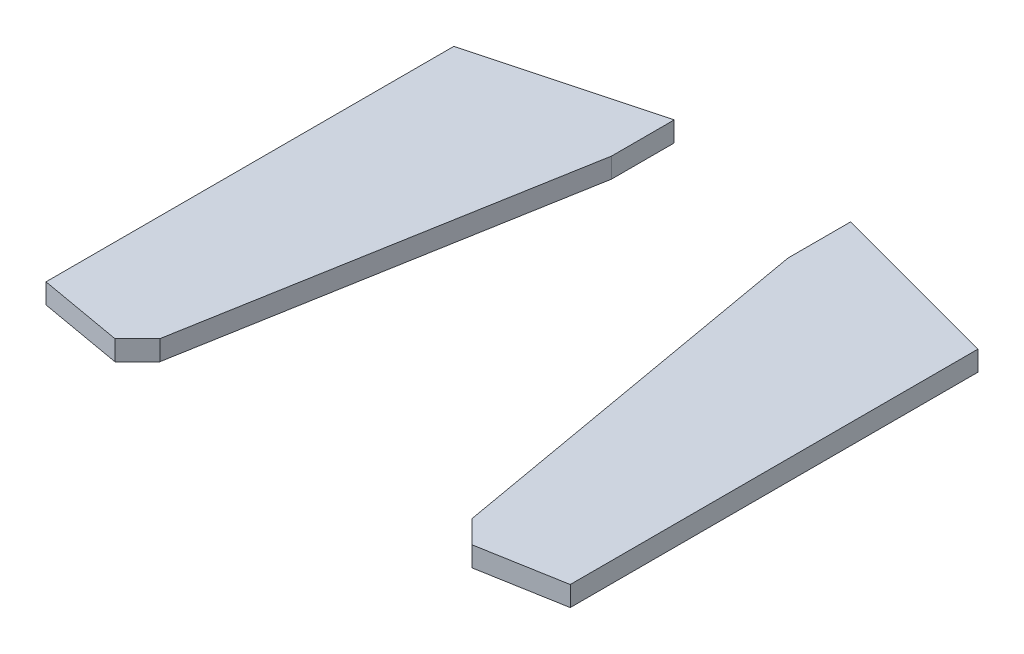
ISO-10303-21;
HEADER;
FILE_DESCRIPTION(('STEP AP214'),'2;1');
FILE_NAME('part.step','',(''),(''),'','','');
FILE_SCHEMA(('AUTOMOTIVE_DESIGN { 1 0 10303 214 1 1 1 1 }'));
ENDSEC;
DATA;
#1=APPLICATION_CONTEXT('core data for automotive mechanical design processes');
#2=APPLICATION_PROTOCOL_DEFINITION('international standard','automotive_design',2000,#1);
#3=PRODUCT_CONTEXT('',#1,'mechanical');
#4=PRODUCT('Part','Part','',(#3));
#5=PRODUCT_RELATED_PRODUCT_CATEGORY('part','',(#4));
#6=PRODUCT_DEFINITION_FORMATION('','',#4);
#7=PRODUCT_DEFINITION_CONTEXT('part definition',#1,'design');
#8=PRODUCT_DEFINITION('design','',#6,#7);
#9=PRODUCT_DEFINITION_SHAPE('','',#8);
#10=(LENGTH_UNIT() NAMED_UNIT(*) SI_UNIT(.MILLI.,.METRE.));
#11=(NAMED_UNIT(*) PLANE_ANGLE_UNIT() SI_UNIT($,.RADIAN.));
#12=(NAMED_UNIT(*) SI_UNIT($,.STERADIAN.) SOLID_ANGLE_UNIT());
#13=UNCERTAINTY_MEASURE_WITH_UNIT(LENGTH_MEASURE(1.E-05),#10,'distance_accuracy_value','');
#14=(GEOMETRIC_REPRESENTATION_CONTEXT(3) GLOBAL_UNCERTAINTY_ASSIGNED_CONTEXT((#13)) GLOBAL_UNIT_ASSIGNED_CONTEXT((#10,
#11,#12)) REPRESENTATION_CONTEXT('',''));
#15=CARTESIAN_POINT('',(0.,0.,0.));
#16=DIRECTION('',(0.,0.,1.));
#17=DIRECTION('',(1.,0.,0.));
#18=AXIS2_PLACEMENT_3D('',#15,#16,#17);
#19=CARTESIAN_POINT('',(982.928076994621,75.,748.468756702512));
#20=DIRECTION('',(-1.,0.,0.));
#21=DIRECTION('',(0.,0.,1.));
#22=AXIS2_PLACEMENT_3D('',#19,#20,#21);
#23=PLANE('',#22);
#24=DIRECTION('',(0.,0.,-1.));
#25=VECTOR('',#24,1.);
#26=CARTESIAN_POINT('',(982.928076994621,0.,748.468756702512));
#27=LINE('',#26,#25);
#28=CARTESIAN_POINT('',(982.928076994621,0.,748.468756702512));
#29=VERTEX_POINT('',#28);
#30=CARTESIAN_POINT('',(982.928076994621,0.,-780.737776154885));
#31=VERTEX_POINT('',#30);
#32=EDGE_CURVE('E12',#29,#31,#27,.T.);
#33=ORIENTED_EDGE('',*,*,#32,.T.);
#34=DIRECTION('',(0.,-1.,0.));
#35=VECTOR('',#34,1.);
#36=CARTESIAN_POINT('',(982.928076994621,75.,-780.737776154885));
#37=LINE('',#36,#35);
#38=CARTESIAN_POINT('',(982.928076994621,75.,-780.737776154885));
#39=VERTEX_POINT('',#38);
#40=EDGE_CURVE('E168',#39,#31,#37,.T.);
#41=ORIENTED_EDGE('',*,*,#40,.F.);
#42=DIRECTION('',(0.,0.,-1.));
#43=VECTOR('',#42,1.);
#44=CARTESIAN_POINT('',(982.928076994621,75.,748.468756702512));
#45=LINE('',#44,#43);
#46=CARTESIAN_POINT('',(982.928076994621,75.,748.468756702512));
#47=VERTEX_POINT('',#46);
#48=EDGE_CURVE('E53',#47,#39,#45,.T.);
#49=ORIENTED_EDGE('',*,*,#48,.F.);
#50=DIRECTION('',(0.,-1.,0.));
#51=VECTOR('',#50,1.);
#52=CARTESIAN_POINT('',(982.928076994621,75.,748.468756702512));
#53=LINE('',#52,#51);
#54=EDGE_CURVE('E144',#47,#29,#53,.T.);
#55=ORIENTED_EDGE('',*,*,#54,.T.);
#56=EDGE_LOOP('',(#33,#41,#49,#55));
#57=FACE_BOUND('',#56,.T.);
#58=ADVANCED_FACE('F49',(#57),#23,.F.);
#59=CARTESIAN_POINT('',(982.928076994621,75.,-780.737776154885));
#60=DIRECTION('',(-0.258819045102514,0.,0.96592582628907));
#61=DIRECTION('',(0.96592582628907,0.,0.258819045102514));
#62=AXIS2_PLACEMENT_3D('',#59,#60,#61);
#63=PLANE('',#62);
#64=DIRECTION('',(-0.96592582628907,0.,-0.258819045102514));
#65=VECTOR('',#64,1.);
#66=CARTESIAN_POINT('',(982.928076994621,0.,-780.737776154885));
#67=LINE('',#66,#65);
#68=CARTESIAN_POINT('',(330.905406559867,0.,-955.446724144657));
#69=VERTEX_POINT('',#68);
#70=EDGE_CURVE('E60',#31,#69,#67,.T.);
#71=ORIENTED_EDGE('',*,*,#70,.T.);
#72=DIRECTION('',(0.,-1.,0.));
#73=VECTOR('',#72,1.);
#74=CARTESIAN_POINT('',(330.905406559867,75.,-955.446724144657));
#75=LINE('',#74,#73);
#76=CARTESIAN_POINT('',(330.905406559867,75.,-955.446724144657));
#77=VERTEX_POINT('',#76);
#78=EDGE_CURVE('E125',#77,#69,#75,.T.);
#79=ORIENTED_EDGE('',*,*,#78,.F.);
#80=DIRECTION('',(-0.96592582628907,0.,-0.258819045102514));
#81=VECTOR('',#80,1.);
#82=CARTESIAN_POINT('',(982.928076994621,75.,-780.737776154885));
#83=LINE('',#82,#81);
#84=EDGE_CURVE('E92',#39,#77,#83,.T.);
#85=ORIENTED_EDGE('',*,*,#84,.F.);
#86=ORIENTED_EDGE('',*,*,#40,.T.);
#87=EDGE_LOOP('',(#71,#79,#85,#86));
#88=FACE_BOUND('',#87,.T.);
#89=ADVANCED_FACE('F170',(#88),#63,.F.);
#90=CARTESIAN_POINT('',(330.905406559867,75.,-720.543070196933));
#91=DIRECTION('',(-1.,0.,0.));
#92=DIRECTION('',(0.,0.,1.));
#93=AXIS2_PLACEMENT_3D('',#90,#91,#92);
#94=PLANE('',#93);
#95=DIRECTION('',(0.,0.,-1.));
#96=VECTOR('',#95,1.);
#97=CARTESIAN_POINT('',(330.905406559867,0.,-720.543070196933));
#98=LINE('',#97,#96);
#99=CARTESIAN_POINT('',(330.905406559867,0.,-720.543070196933));
#100=VERTEX_POINT('',#99);
#101=EDGE_CURVE('E129',#100,#69,#98,.T.);
#102=ORIENTED_EDGE('',*,*,#101,.F.);
#103=DIRECTION('',(0.,-1.,0.));
#104=VECTOR('',#103,1.);
#105=CARTESIAN_POINT('',(330.905406559867,75.,-720.543070196933));
#106=LINE('',#105,#104);
#107=CARTESIAN_POINT('',(330.905406559867,75.,-720.543070196933));
#108=VERTEX_POINT('',#107);
#109=EDGE_CURVE('E113',#108,#100,#106,.T.);
#110=ORIENTED_EDGE('',*,*,#109,.F.);
#111=DIRECTION('',(0.,0.,-1.));
#112=VECTOR('',#111,1.);
#113=CARTESIAN_POINT('',(330.905406559867,75.,-720.543070196933));
#114=LINE('',#113,#112);
#115=EDGE_CURVE('E149',#108,#77,#114,.T.);
#116=ORIENTED_EDGE('',*,*,#115,.T.);
#117=ORIENTED_EDGE('',*,*,#78,.T.);
#118=EDGE_LOOP('',(#102,#110,#116,#117));
#119=FACE_BOUND('',#118,.T.);
#120=ADVANCED_FACE('F133',(#119),#94,.T.);
#121=CARTESIAN_POINT('',(330.905406559867,75.,-720.543070196933));
#122=DIRECTION('',(0.984807753012208,0.,-0.173648177666927));
#123=DIRECTION('',(-0.173648177666927,0.,-0.984807753012209));
#124=AXIS2_PLACEMENT_3D('',#121,#122,#123);
#125=PLANE('',#124);
#126=DIRECTION('',(0.173648177666927,0.,0.984807753012208));
#127=VECTOR('',#126,1.);
#128=CARTESIAN_POINT('',(330.905406559867,0.,-720.543070196933));
#129=LINE('',#128,#127);
#130=CARTESIAN_POINT('',(584.865866397748,0.,719.738268583422));
#131=VERTEX_POINT('',#130);
#132=EDGE_CURVE('E117',#100,#131,#129,.T.);
#133=ORIENTED_EDGE('',*,*,#132,.T.);
#134=DIRECTION('',(0.,-1.,0.));
#135=VECTOR('',#134,1.);
#136=CARTESIAN_POINT('',(584.865866397748,75.,719.738268583422));
#137=LINE('',#136,#135);
#138=CARTESIAN_POINT('',(584.865866397748,75.,719.738268583422));
#139=VERTEX_POINT('',#138);
#140=EDGE_CURVE('E124',#139,#131,#137,.T.);
#141=ORIENTED_EDGE('',*,*,#140,.F.);
#142=DIRECTION('',(0.173648177666927,0.,0.984807753012208));
#143=VECTOR('',#142,1.);
#144=CARTESIAN_POINT('',(330.905406559867,75.,-720.543070196933));
#145=LINE('',#144,#143);
#146=EDGE_CURVE('E119',#108,#139,#145,.T.);
#147=ORIENTED_EDGE('',*,*,#146,.F.);
#148=ORIENTED_EDGE('',*,*,#109,.T.);
#149=EDGE_LOOP('',(#133,#141,#147,#148));
#150=FACE_BOUND('',#149,.T.);
#151=ADVANCED_FACE('F115',(#150),#125,.F.);
#152=CARTESIAN_POINT('',(584.865866397748,75.,719.738268583422));
#153=DIRECTION('',(0.707106781186539,0.,-0.707106781186556));
#154=DIRECTION('',(-0.707106781186556,0.,-0.707106781186539));
#155=AXIS2_PLACEMENT_3D('',#152,#153,#154);
#156=PLANE('',#155);
#157=DIRECTION('',(0.707106781186556,0.,0.707106781186539));
#158=VECTOR('',#157,1.);
#159=CARTESIAN_POINT('',(584.865866397748,0.,719.738268583422));
#160=LINE('',#159,#158);
#161=CARTESIAN_POINT('',(668.957787666271,0.,803.830189851942));
#162=VERTEX_POINT('',#161);
#163=EDGE_CURVE('E130',#131,#162,#160,.T.);
#164=ORIENTED_EDGE('',*,*,#163,.T.);
#165=DIRECTION('',(0.,-1.,0.));
#166=VECTOR('',#165,1.);
#167=CARTESIAN_POINT('',(668.957787666271,75.,803.830189851942));
#168=LINE('',#167,#166);
#169=CARTESIAN_POINT('',(668.957787666271,75.,803.830189851942));
#170=VERTEX_POINT('',#169);
#171=EDGE_CURVE('E161',#170,#162,#168,.T.);
#172=ORIENTED_EDGE('',*,*,#171,.F.);
#173=DIRECTION('',(0.707106781186556,0.,0.707106781186539));
#174=VECTOR('',#173,1.);
#175=CARTESIAN_POINT('',(584.865866397748,75.,719.738268583422));
#176=LINE('',#175,#174);
#177=EDGE_CURVE('E143',#139,#170,#176,.T.);
#178=ORIENTED_EDGE('',*,*,#177,.F.);
#179=ORIENTED_EDGE('',*,*,#140,.T.);
#180=EDGE_LOOP('',(#164,#172,#178,#179));
#181=FACE_BOUND('',#180,.T.);
#182=ADVANCED_FACE('F177',(#181),#156,.F.);
#183=CARTESIAN_POINT('',(668.957787666271,75.,803.830189851942));
#184=DIRECTION('',(-0.173648177666927,0.,-0.984807753012209));
#185=DIRECTION('',(-0.984807753012209,0.,0.173648177666927));
#186=AXIS2_PLACEMENT_3D('',#183,#184,#185);
#187=PLANE('',#186);
#188=DIRECTION('',(0.984807753012209,0.,-0.173648177666927));
#189=VECTOR('',#188,1.);
#190=CARTESIAN_POINT('',(668.957787666271,0.,803.830189851942));
#191=LINE('',#190,#189);
#192=EDGE_CURVE('E103',#162,#29,#191,.T.);
#193=ORIENTED_EDGE('',*,*,#192,.T.);
#194=ORIENTED_EDGE('',*,*,#54,.F.);
#195=DIRECTION('',(0.984807753012209,0.,-0.173648177666927));
#196=VECTOR('',#195,1.);
#197=CARTESIAN_POINT('',(668.957787666271,75.,803.830189851942));
#198=LINE('',#197,#196);
#199=EDGE_CURVE('E140',#170,#47,#198,.T.);
#200=ORIENTED_EDGE('',*,*,#199,.F.);
#201=ORIENTED_EDGE('',*,*,#171,.T.);
#202=EDGE_LOOP('',(#193,#194,#200,#201));
#203=FACE_BOUND('',#202,.T.);
#204=ADVANCED_FACE('F173',(#203),#187,.F.);
#205=CARTESIAN_POINT('',(0.,75.,0.));
#206=DIRECTION('',(0.,-1.,0.));
#207=DIRECTION('',(0.,0.,-1.));
#208=AXIS2_PLACEMENT_3D('',#205,#206,#207);
#209=PLANE('',#208);
#210=ORIENTED_EDGE('',*,*,#48,.T.);
#211=ORIENTED_EDGE('',*,*,#84,.T.);
#212=ORIENTED_EDGE('',*,*,#115,.F.);
#213=ORIENTED_EDGE('',*,*,#146,.T.);
#214=ORIENTED_EDGE('',*,*,#177,.T.);
#215=ORIENTED_EDGE('',*,*,#199,.T.);
#216=EDGE_LOOP('',(#210,#211,#212,#213,#214,#215));
#217=FACE_BOUND('',#216,.T.);
#218=ADVANCED_FACE('F51',(#217),#209,.F.);
#219=CARTESIAN_POINT('',(0.,0.,0.));
#220=DIRECTION('',(0.,-1.,0.));
#221=DIRECTION('',(0.,0.,-1.));
#222=AXIS2_PLACEMENT_3D('',#219,#220,#221);
#223=PLANE('',#222);
#224=ORIENTED_EDGE('',*,*,#32,.F.);
#225=ORIENTED_EDGE('',*,*,#192,.F.);
#226=ORIENTED_EDGE('',*,*,#163,.F.);
#227=ORIENTED_EDGE('',*,*,#132,.F.);
#228=ORIENTED_EDGE('',*,*,#101,.T.);
#229=ORIENTED_EDGE('',*,*,#70,.F.);
#230=EDGE_LOOP('',(#224,#225,#226,#227,#228,#229));
#231=FACE_BOUND('',#230,.T.);
#232=ADVANCED_FACE('F128',(#231),#223,.T.);
#233=CLOSED_SHELL('',(#58,#89,#120,#151,#182,#204,#218,#232));
#234=MANIFOLD_SOLID_BREP('B2',#233);
#235=CARTESIAN_POINT('',(-669.226054870774,75.,803.830189851942));
#236=DIRECTION('',(-0.173648177666927,0.,0.984807753012209));
#237=DIRECTION('',(0.984807753012209,0.,0.173648177666927));
#238=AXIS2_PLACEMENT_3D('',#235,#236,#237);
#239=PLANE('',#238);
#240=DIRECTION('',(-0.984807753012209,0.,-0.173648177666927));
#241=VECTOR('',#240,1.);
#242=CARTESIAN_POINT('',(-669.226054870774,0.,803.830189851942));
#243=LINE('',#242,#241);
#244=CARTESIAN_POINT('',(-669.226054870774,0.,803.830189851942));
#245=VERTEX_POINT('',#244);
#246=CARTESIAN_POINT('',(-983.196344199125,0.,748.468756702512));
#247=VERTEX_POINT('',#246);
#248=EDGE_CURVE('E326',#245,#247,#243,.T.);
#249=ORIENTED_EDGE('',*,*,#248,.F.);
#250=DIRECTION('',(0.,-1.,0.));
#251=VECTOR('',#250,1.);
#252=CARTESIAN_POINT('',(-669.226054870774,75.,803.830189851942));
#253=LINE('',#252,#251);
#254=CARTESIAN_POINT('',(-669.226054870774,75.,803.830189851942));
#255=VERTEX_POINT('',#254);
#256=EDGE_CURVE('E47',#255,#245,#253,.T.);
#257=ORIENTED_EDGE('',*,*,#256,.F.);
#258=DIRECTION('',(-0.984807753012209,0.,-0.173648177666927));
#259=VECTOR('',#258,1.);
#260=CARTESIAN_POINT('',(-669.226054870774,75.,803.830189851942));
#261=LINE('',#260,#259);
#262=CARTESIAN_POINT('',(-983.196344199125,75.,748.468756702512));
#263=VERTEX_POINT('',#262);
#264=EDGE_CURVE('E340',#255,#263,#261,.T.);
#265=ORIENTED_EDGE('',*,*,#264,.T.);
#266=DIRECTION('',(0.,-1.,0.));
#267=VECTOR('',#266,1.);
#268=CARTESIAN_POINT('',(-983.196344199125,75.,748.468756702512));
#269=LINE('',#268,#267);
#270=EDGE_CURVE('E246',#263,#247,#269,.T.);
#271=ORIENTED_EDGE('',*,*,#270,.T.);
#272=EDGE_LOOP('',(#249,#257,#265,#271));
#273=FACE_BOUND('',#272,.T.);
#274=ADVANCED_FACE('F243',(#273),#239,.T.);
#275=CARTESIAN_POINT('',(-585.134133602252,75.,719.738268583422));
#276=DIRECTION('',(0.707106781186539,0.,0.707106781186556));
#277=DIRECTION('',(0.707106781186556,0.,-0.707106781186539));
#278=AXIS2_PLACEMENT_3D('',#275,#276,#277);
#279=PLANE('',#278);
#280=DIRECTION('',(-0.707106781186556,0.,0.707106781186539));
#281=VECTOR('',#280,1.);
#282=CARTESIAN_POINT('',(-585.134133602252,0.,719.738268583422));
#283=LINE('',#282,#281);
#284=CARTESIAN_POINT('',(-585.134133602252,0.,719.738268583422));
#285=VERTEX_POINT('',#284);
#286=EDGE_CURVE('E338',#285,#245,#283,.T.);
#287=ORIENTED_EDGE('',*,*,#286,.F.);
#288=DIRECTION('',(0.,-1.,0.));
#289=VECTOR('',#288,1.);
#290=CARTESIAN_POINT('',(-585.134133602252,75.,719.738268583422));
#291=LINE('',#290,#289);
#292=CARTESIAN_POINT('',(-585.134133602252,75.,719.738268583422));
#293=VERTEX_POINT('',#292);
#294=EDGE_CURVE('E252',#293,#285,#291,.T.);
#295=ORIENTED_EDGE('',*,*,#294,.F.);
#296=DIRECTION('',(-0.707106781186556,0.,0.707106781186539));
#297=VECTOR('',#296,1.);
#298=CARTESIAN_POINT('',(-585.134133602252,75.,719.738268583422));
#299=LINE('',#298,#297);
#300=EDGE_CURVE('E321',#293,#255,#299,.T.);
#301=ORIENTED_EDGE('',*,*,#300,.T.);
#302=ORIENTED_EDGE('',*,*,#256,.T.);
#303=EDGE_LOOP('',(#287,#295,#301,#302));
#304=FACE_BOUND('',#303,.T.);
#305=ADVANCED_FACE('F348',(#304),#279,.T.);
#306=CARTESIAN_POINT('',(-331.17367376437,75.,-720.543070196932));
#307=DIRECTION('',(0.984807753012208,0.,0.173648177666928));
#308=DIRECTION('',(0.173648177666928,0.,-0.984807753012209));
#309=AXIS2_PLACEMENT_3D('',#306,#307,#308);
#310=PLANE('',#309);
#311=DIRECTION('',(-0.173648177666928,0.,0.984807753012208));
#312=VECTOR('',#311,1.);
#313=CARTESIAN_POINT('',(-331.17367376437,0.,-720.543070196932));
#314=LINE('',#313,#312);
#315=CARTESIAN_POINT('',(-331.17367376437,0.,-720.543070196932));
#316=VERTEX_POINT('',#315);
#317=EDGE_CURVE('E306',#316,#285,#314,.T.);
#318=ORIENTED_EDGE('',*,*,#317,.F.);
#319=DIRECTION('',(0.,-1.,0.));
#320=VECTOR('',#319,1.);
#321=CARTESIAN_POINT('',(-331.17367376437,75.,-720.543070196932));
#322=LINE('',#321,#320);
#323=CARTESIAN_POINT('',(-331.17367376437,75.,-720.543070196932));
#324=VERTEX_POINT('',#323);
#325=EDGE_CURVE('E300',#324,#316,#322,.T.);
#326=ORIENTED_EDGE('',*,*,#325,.F.);
#327=DIRECTION('',(-0.173648177666928,0.,0.984807753012208));
#328=VECTOR('',#327,1.);
#329=CARTESIAN_POINT('',(-331.17367376437,75.,-720.543070196932));
#330=LINE('',#329,#328);
#331=EDGE_CURVE('E304',#324,#293,#330,.T.);
#332=ORIENTED_EDGE('',*,*,#331,.T.);
#333=ORIENTED_EDGE('',*,*,#294,.T.);
#334=EDGE_LOOP('',(#318,#326,#332,#333));
#335=FACE_BOUND('',#334,.T.);
#336=ADVANCED_FACE('F302',(#335),#310,.T.);
#337=CARTESIAN_POINT('',(-331.17367376437,75.,-720.543070196932));
#338=DIRECTION('',(-1.,0.,0.));
#339=DIRECTION('',(0.,0.,1.));
#340=AXIS2_PLACEMENT_3D('',#337,#338,#339);
#341=PLANE('',#340);
#342=DIRECTION('',(0.,0.,-1.));
#343=VECTOR('',#342,1.);
#344=CARTESIAN_POINT('',(-331.17367376437,0.,-720.543070196932));
#345=LINE('',#344,#343);
#346=CARTESIAN_POINT('',(-331.17367376437,0.,-955.446724144656));
#347=VERTEX_POINT('',#346);
#348=EDGE_CURVE('E335',#316,#347,#345,.T.);
#349=ORIENTED_EDGE('',*,*,#348,.T.);
#350=DIRECTION('',(0.,-1.,0.));
#351=VECTOR('',#350,1.);
#352=CARTESIAN_POINT('',(-331.17367376437,75.,-955.446724144656));
#353=LINE('',#352,#351);
#354=CARTESIAN_POINT('',(-331.17367376437,75.,-955.446724144656));
#355=VERTEX_POINT('',#354);
#356=EDGE_CURVE('E310',#355,#347,#353,.T.);
#357=ORIENTED_EDGE('',*,*,#356,.F.);
#358=DIRECTION('',(0.,0.,-1.));
#359=VECTOR('',#358,1.);
#360=CARTESIAN_POINT('',(-331.17367376437,75.,-720.543070196932));
#361=LINE('',#360,#359);
#362=EDGE_CURVE('E313',#324,#355,#361,.T.);
#363=ORIENTED_EDGE('',*,*,#362,.F.);
#364=ORIENTED_EDGE('',*,*,#325,.T.);
#365=EDGE_LOOP('',(#349,#357,#363,#364));
#366=FACE_BOUND('',#365,.T.);
#367=ADVANCED_FACE('F314',(#366),#341,.F.);
#368=CARTESIAN_POINT('',(-983.196344199125,75.,-780.737776154884));
#369=DIRECTION('',(-0.258819045102514,0.,-0.96592582628907));
#370=DIRECTION('',(-0.96592582628907,0.,0.258819045102514));
#371=AXIS2_PLACEMENT_3D('',#368,#369,#370);
#372=PLANE('',#371);
#373=DIRECTION('',(0.96592582628907,0.,-0.258819045102514));
#374=VECTOR('',#373,1.);
#375=CARTESIAN_POINT('',(-983.196344199125,0.,-780.737776154884));
#376=LINE('',#375,#374);
#377=CARTESIAN_POINT('',(-983.196344199125,0.,-780.737776154884));
#378=VERTEX_POINT('',#377);
#379=EDGE_CURVE('E332',#378,#347,#376,.T.);
#380=ORIENTED_EDGE('',*,*,#379,.F.);
#381=DIRECTION('',(0.,-1.,0.));
#382=VECTOR('',#381,1.);
#383=CARTESIAN_POINT('',(-983.196344199125,75.,-780.737776154884));
#384=LINE('',#383,#382);
#385=CARTESIAN_POINT('',(-983.196344199125,75.,-780.737776154884));
#386=VERTEX_POINT('',#385);
#387=EDGE_CURVE('E343',#386,#378,#384,.T.);
#388=ORIENTED_EDGE('',*,*,#387,.F.);
#389=DIRECTION('',(0.96592582628907,0.,-0.258819045102514));
#390=VECTOR('',#389,1.);
#391=CARTESIAN_POINT('',(-983.196344199125,75.,-780.737776154884));
#392=LINE('',#391,#390);
#393=EDGE_CURVE('E318',#386,#355,#392,.T.);
#394=ORIENTED_EDGE('',*,*,#393,.T.);
#395=ORIENTED_EDGE('',*,*,#356,.T.);
#396=EDGE_LOOP('',(#380,#388,#394,#395));
#397=FACE_BOUND('',#396,.T.);
#398=ADVANCED_FACE('F361',(#397),#372,.T.);
#399=CARTESIAN_POINT('',(-983.196344199125,75.,748.468756702512));
#400=DIRECTION('',(-1.,0.,0.));
#401=DIRECTION('',(0.,0.,1.));
#402=AXIS2_PLACEMENT_3D('',#399,#400,#401);
#403=PLANE('',#402);
#404=DIRECTION('',(0.,0.,-1.));
#405=VECTOR('',#404,1.);
#406=CARTESIAN_POINT('',(-983.196344199125,0.,748.468756702512));
#407=LINE('',#406,#405);
#408=EDGE_CURVE('E329',#247,#378,#407,.T.);
#409=ORIENTED_EDGE('',*,*,#408,.F.);
#410=ORIENTED_EDGE('',*,*,#270,.F.);
#411=DIRECTION('',(0.,0.,-1.));
#412=VECTOR('',#411,1.);
#413=CARTESIAN_POINT('',(-983.196344199125,75.,748.468756702512));
#414=LINE('',#413,#412);
#415=EDGE_CURVE('E413',#263,#386,#414,.T.);
#416=ORIENTED_EDGE('',*,*,#415,.T.);
#417=ORIENTED_EDGE('',*,*,#387,.T.);
#418=EDGE_LOOP('',(#409,#410,#416,#417));
#419=FACE_BOUND('',#418,.T.);
#420=ADVANCED_FACE('F345',(#419),#403,.T.);
#421=CARTESIAN_POINT('',(0.,75.,0.));
#422=DIRECTION('',(0.,1.,0.));
#423=DIRECTION('',(0.,0.,1.));
#424=AXIS2_PLACEMENT_3D('',#421,#422,#423);
#425=PLANE('',#424);
#426=ORIENTED_EDGE('',*,*,#264,.F.);
#427=ORIENTED_EDGE('',*,*,#300,.F.);
#428=ORIENTED_EDGE('',*,*,#331,.F.);
#429=ORIENTED_EDGE('',*,*,#362,.T.);
#430=ORIENTED_EDGE('',*,*,#393,.F.);
#431=ORIENTED_EDGE('',*,*,#415,.F.);
#432=EDGE_LOOP('',(#426,#427,#428,#429,#430,#431));
#433=FACE_BOUND('',#432,.T.);
#434=ADVANCED_FACE('F320',(#433),#425,.T.);
#435=CARTESIAN_POINT('',(0.,0.,0.));
#436=DIRECTION('',(0.,1.,0.));
#437=DIRECTION('',(0.,0.,1.));
#438=AXIS2_PLACEMENT_3D('',#435,#436,#437);
#439=PLANE('',#438);
#440=ORIENTED_EDGE('',*,*,#248,.T.);
#441=ORIENTED_EDGE('',*,*,#408,.T.);
#442=ORIENTED_EDGE('',*,*,#379,.T.);
#443=ORIENTED_EDGE('',*,*,#348,.F.);
#444=ORIENTED_EDGE('',*,*,#317,.T.);
#445=ORIENTED_EDGE('',*,*,#286,.T.);
#446=EDGE_LOOP('',(#440,#441,#442,#443,#444,#445));
#447=FACE_BOUND('',#446,.T.);
#448=ADVANCED_FACE('F347',(#447),#439,.F.);
#449=CLOSED_SHELL('',(#274,#305,#336,#367,#398,#420,#434,#448));
#450=MANIFOLD_SOLID_BREP('B6',#449);
#451=ADVANCED_BREP_SHAPE_REPRESENTATION('',(#18,#234,#450),#14);
#452=SHAPE_DEFINITION_REPRESENTATION(#9,#451);
ENDSEC;
END-ISO-10303-21;
